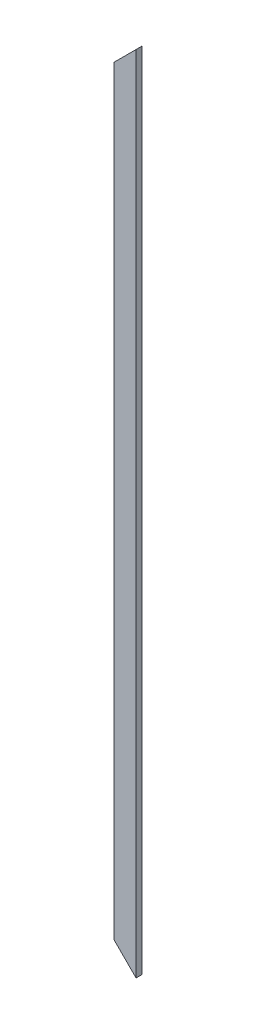
ISO-10303-21;
HEADER;
FILE_DESCRIPTION(('STEP AP214'),'2;1');
FILE_NAME('part.step','',(''),(''),'','','');
FILE_SCHEMA(('AUTOMOTIVE_DESIGN { 1 0 10303 214 1 1 1 1 }'));
ENDSEC;
DATA;
#1=APPLICATION_CONTEXT('core data for automotive mechanical design processes');
#2=APPLICATION_PROTOCOL_DEFINITION('international standard','automotive_design',2000,#1);
#3=PRODUCT_CONTEXT('',#1,'mechanical');
#4=PRODUCT('Part','Part','',(#3));
#5=PRODUCT_RELATED_PRODUCT_CATEGORY('part','',(#4));
#6=PRODUCT_DEFINITION_FORMATION('','',#4);
#7=PRODUCT_DEFINITION_CONTEXT('part definition',#1,'design');
#8=PRODUCT_DEFINITION('design','',#6,#7);
#9=PRODUCT_DEFINITION_SHAPE('','',#8);
#10=(LENGTH_UNIT() NAMED_UNIT(*) SI_UNIT(.MILLI.,.METRE.));
#11=(NAMED_UNIT(*) PLANE_ANGLE_UNIT() SI_UNIT($,.RADIAN.));
#12=(NAMED_UNIT(*) SI_UNIT($,.STERADIAN.) SOLID_ANGLE_UNIT());
#13=UNCERTAINTY_MEASURE_WITH_UNIT(LENGTH_MEASURE(1.E-05),#10,'distance_accuracy_value','');
#14=(GEOMETRIC_REPRESENTATION_CONTEXT(3) GLOBAL_UNCERTAINTY_ASSIGNED_CONTEXT((#13)) GLOBAL_UNIT_ASSIGNED_CONTEXT((#10,
#11,#12)) REPRESENTATION_CONTEXT('',''));
#15=CARTESIAN_POINT('',(0.,0.,0.));
#16=DIRECTION('',(0.,0.,1.));
#17=DIRECTION('',(1.,0.,0.));
#18=AXIS2_PLACEMENT_3D('',#15,#16,#17);
#19=CARTESIAN_POINT('',(-69.85,5054.6,19.05));
#20=DIRECTION('',(-1.,0.,0.));
#21=DIRECTION('',(0.,0.,1.));
#22=AXIS2_PLACEMENT_3D('',#19,#20,#21);
#23=PLANE('',#22);
#24=DIRECTION('',(0.,0.,-1.));
#25=VECTOR('',#24,1.);
#26=CARTESIAN_POINT('',(-69.85,139.7,19.05));
#27=LINE('',#26,#25);
#28=CARTESIAN_POINT('',(-69.85,139.7,19.05));
#29=VERTEX_POINT('',#28);
#30=CARTESIAN_POINT('',(-69.85,139.7,-19.05));
#31=VERTEX_POINT('',#30);
#32=EDGE_CURVE('E79',#29,#31,#27,.T.);
#33=ORIENTED_EDGE('',*,*,#32,.F.);
#34=DIRECTION('',(0.,-1.,0.));
#35=VECTOR('',#34,1.);
#36=CARTESIAN_POINT('',(-69.85,5054.6,19.05));
#37=LINE('',#36,#35);
#38=CARTESIAN_POINT('',(-69.85,4914.9,19.05));
#39=VERTEX_POINT('',#38);
#40=EDGE_CURVE('E11',#39,#29,#37,.T.);
#41=ORIENTED_EDGE('',*,*,#40,.F.);
#42=DIRECTION('',(0.,0.,-1.));
#43=VECTOR('',#42,1.);
#44=CARTESIAN_POINT('',(-69.85,4914.9,19.05));
#45=LINE('',#44,#43);
#46=CARTESIAN_POINT('',(-69.85,4914.9,-19.05));
#47=VERTEX_POINT('',#46);
#48=EDGE_CURVE('E95',#39,#47,#45,.T.);
#49=ORIENTED_EDGE('',*,*,#48,.T.);
#50=DIRECTION('',(0.,-1.,0.));
#51=VECTOR('',#50,1.);
#52=CARTESIAN_POINT('',(-69.85,5054.6,-19.05));
#53=LINE('',#52,#51);
#54=EDGE_CURVE('E42',#47,#31,#53,.T.);
#55=ORIENTED_EDGE('',*,*,#54,.T.);
#56=EDGE_LOOP('',(#33,#41,#49,#55));
#57=FACE_BOUND('',#56,.T.);
#58=ADVANCED_FACE('F39',(#57),#23,.T.);
#59=CARTESIAN_POINT('',(-69.85,5054.6,19.05));
#60=DIRECTION('',(0.,0.,-1.));
#61=DIRECTION('',(-1.,0.,0.));
#62=AXIS2_PLACEMENT_3D('',#59,#60,#61);
#63=PLANE('',#62);
#64=ORIENTED_EDGE('',*,*,#40,.T.);
#65=DIRECTION('',(0.707106781186548,-0.707106781186548,0.));
#66=VECTOR('',#65,1.);
#67=CARTESIAN_POINT('',(69.85,0.,19.05));
#68=LINE('',#67,#66);
#69=CARTESIAN_POINT('',(69.85,0.,19.05));
#70=VERTEX_POINT('',#69);
#71=EDGE_CURVE('E76',#29,#70,#68,.T.);
#72=ORIENTED_EDGE('',*,*,#71,.T.);
#73=DIRECTION('',(0.,-1.,0.));
#74=VECTOR('',#73,1.);
#75=CARTESIAN_POINT('',(69.85,5054.6,19.05));
#76=LINE('',#75,#74);
#77=CARTESIAN_POINT('',(69.85,5054.6,19.05));
#78=VERTEX_POINT('',#77);
#79=EDGE_CURVE('E48',#78,#70,#76,.T.);
#80=ORIENTED_EDGE('',*,*,#79,.F.);
#81=DIRECTION('',(-0.707106781186547,-0.707106781186549,0.));
#82=VECTOR('',#81,1.);
#83=CARTESIAN_POINT('',(69.85,5054.6,19.05));
#84=LINE('',#83,#82);
#85=EDGE_CURVE('E55',#78,#39,#84,.T.);
#86=ORIENTED_EDGE('',*,*,#85,.T.);
#87=EDGE_LOOP('',(#64,#72,#80,#86));
#88=FACE_BOUND('',#87,.T.);
#89=ADVANCED_FACE('F93',(#88),#63,.F.);
#90=CARTESIAN_POINT('',(69.85,5054.6,19.05));
#91=DIRECTION('',(-1.,0.,0.));
#92=DIRECTION('',(0.,0.,1.));
#93=AXIS2_PLACEMENT_3D('',#90,#91,#92);
#94=PLANE('',#93);
#95=DIRECTION('',(0.,0.,-1.));
#96=VECTOR('',#95,1.);
#97=CARTESIAN_POINT('',(69.85,0.,19.05));
#98=LINE('',#97,#96);
#99=CARTESIAN_POINT('',(69.85,0.,-19.05));
#100=VERTEX_POINT('',#99);
#101=EDGE_CURVE('E82',#70,#100,#98,.T.);
#102=ORIENTED_EDGE('',*,*,#101,.T.);
#103=DIRECTION('',(0.,-1.,0.));
#104=VECTOR('',#103,1.);
#105=CARTESIAN_POINT('',(69.85,5054.6,-19.05));
#106=LINE('',#105,#104);
#107=CARTESIAN_POINT('',(69.85,5054.6,-19.05));
#108=VERTEX_POINT('',#107);
#109=EDGE_CURVE('E105',#108,#100,#106,.T.);
#110=ORIENTED_EDGE('',*,*,#109,.F.);
#111=DIRECTION('',(0.,0.,-1.));
#112=VECTOR('',#111,1.);
#113=CARTESIAN_POINT('',(69.85,5054.6,19.05));
#114=LINE('',#113,#112);
#115=EDGE_CURVE('E102',#78,#108,#114,.T.);
#116=ORIENTED_EDGE('',*,*,#115,.F.);
#117=ORIENTED_EDGE('',*,*,#79,.T.);
#118=EDGE_LOOP('',(#102,#110,#116,#117));
#119=FACE_BOUND('',#118,.T.);
#120=ADVANCED_FACE('F112',(#119),#94,.F.);
#121=CARTESIAN_POINT('',(-69.85,5054.6,-19.05));
#122=DIRECTION('',(0.,0.,-1.));
#123=DIRECTION('',(-1.,0.,0.));
#124=AXIS2_PLACEMENT_3D('',#121,#122,#123);
#125=PLANE('',#124);
#126=DIRECTION('',(0.707106781186548,-0.707106781186548,0.));
#127=VECTOR('',#126,1.);
#128=CARTESIAN_POINT('',(-2527.3,2597.15,-19.05));
#129=LINE('',#128,#127);
#130=EDGE_CURVE('E91',#31,#100,#129,.T.);
#131=ORIENTED_EDGE('',*,*,#130,.F.);
#132=ORIENTED_EDGE('',*,*,#54,.F.);
#133=DIRECTION('',(-0.707106781186547,-0.707106781186549,0.));
#134=VECTOR('',#133,1.);
#135=CARTESIAN_POINT('',(2.22044604925031E-13,4984.75,-19.05));
#136=LINE('',#135,#134);
#137=EDGE_CURVE('E100',#108,#47,#136,.T.);
#138=ORIENTED_EDGE('',*,*,#137,.F.);
#139=ORIENTED_EDGE('',*,*,#109,.T.);
#140=EDGE_LOOP('',(#131,#132,#138,#139));
#141=FACE_BOUND('',#140,.T.);
#142=ADVANCED_FACE('F110',(#141),#125,.T.);
#143=CARTESIAN_POINT('',(69.85,0.,19.05));
#144=DIRECTION('',(0.707106781186548,0.707106781186548,0.));
#145=DIRECTION('',(-0.707106781186548,0.707106781186548,0.));
#146=AXIS2_PLACEMENT_3D('',#143,#144,#145);
#147=PLANE('',#146);
#148=ORIENTED_EDGE('',*,*,#130,.T.);
#149=ORIENTED_EDGE('',*,*,#101,.F.);
#150=ORIENTED_EDGE('',*,*,#71,.F.);
#151=ORIENTED_EDGE('',*,*,#32,.T.);
#152=EDGE_LOOP('',(#148,#149,#150,#151));
#153=FACE_BOUND('',#152,.T.);
#154=ADVANCED_FACE('F78',(#153),#147,.F.);
#155=CARTESIAN_POINT('',(69.85,5054.6,19.05));
#156=DIRECTION('',(0.707106781186549,-0.707106781186547,0.));
#157=DIRECTION('',(0.707106781186547,0.707106781186549,0.));
#158=AXIS2_PLACEMENT_3D('',#155,#156,#157);
#159=PLANE('',#158);
#160=ORIENTED_EDGE('',*,*,#137,.T.);
#161=ORIENTED_EDGE('',*,*,#48,.F.);
#162=ORIENTED_EDGE('',*,*,#85,.F.);
#163=ORIENTED_EDGE('',*,*,#115,.T.);
#164=EDGE_LOOP('',(#160,#161,#162,#163));
#165=FACE_BOUND('',#164,.T.);
#166=ADVANCED_FACE('F113',(#165),#159,.F.);
#167=CLOSED_SHELL('',(#58,#89,#120,#142,#154,#166));
#168=MANIFOLD_SOLID_BREP('B2',#167);
#169=ADVANCED_BREP_SHAPE_REPRESENTATION('',(#18,#168),#14);
#170=SHAPE_DEFINITION_REPRESENTATION(#9,#169);
ENDSEC;
END-ISO-10303-21;
